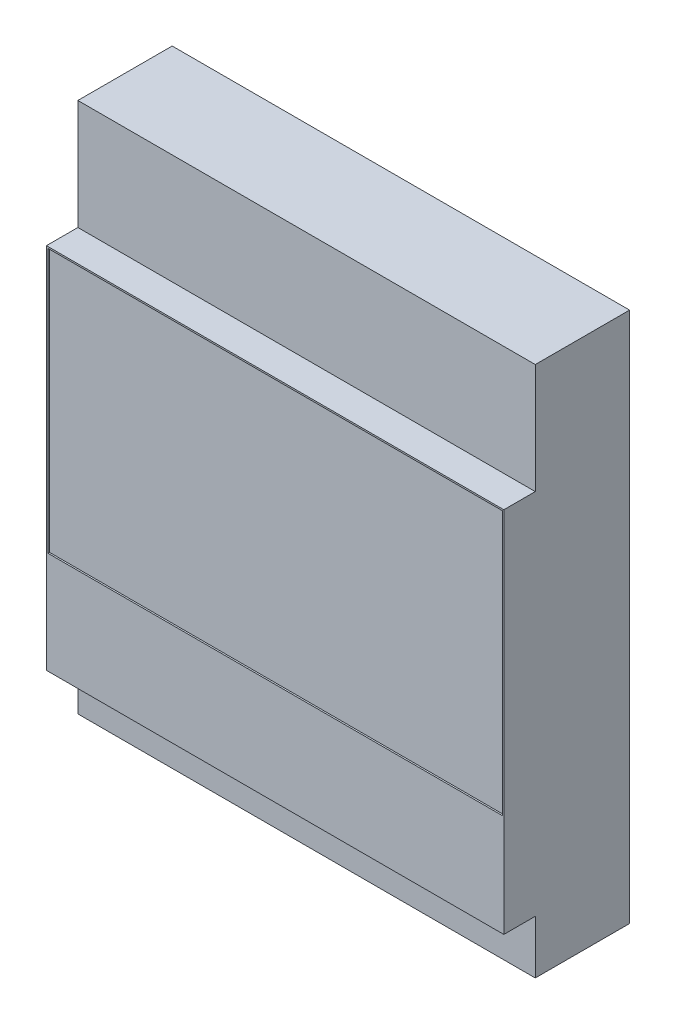
ISO-10303-21;
HEADER;
FILE_DESCRIPTION(('STEP AP214'),'2;1');
FILE_NAME('part.step','',(''),(''),'','','');
FILE_SCHEMA(('AUTOMOTIVE_DESIGN { 1 0 10303 214 1 1 1 1 }'));
ENDSEC;
DATA;
#1=APPLICATION_CONTEXT('core data for automotive mechanical design processes');
#2=APPLICATION_PROTOCOL_DEFINITION('international standard','automotive_design',2000,#1);
#3=PRODUCT_CONTEXT('',#1,'mechanical');
#4=PRODUCT('Part','Part','',(#3));
#5=PRODUCT_RELATED_PRODUCT_CATEGORY('part','',(#4));
#6=PRODUCT_DEFINITION_FORMATION('','',#4);
#7=PRODUCT_DEFINITION_CONTEXT('part definition',#1,'design');
#8=PRODUCT_DEFINITION('design','',#6,#7);
#9=PRODUCT_DEFINITION_SHAPE('','',#8);
#10=(LENGTH_UNIT() NAMED_UNIT(*) SI_UNIT(.MILLI.,.METRE.));
#11=(NAMED_UNIT(*) PLANE_ANGLE_UNIT() SI_UNIT($,.RADIAN.));
#12=(NAMED_UNIT(*) SI_UNIT($,.STERADIAN.) SOLID_ANGLE_UNIT());
#13=UNCERTAINTY_MEASURE_WITH_UNIT(LENGTH_MEASURE(1.E-05),#10,'distance_accuracy_value','');
#14=(GEOMETRIC_REPRESENTATION_CONTEXT(3) GLOBAL_UNCERTAINTY_ASSIGNED_CONTEXT((#13)) GLOBAL_UNIT_ASSIGNED_CONTEXT((#10,
#11,#12)) REPRESENTATION_CONTEXT('',''));
#15=CARTESIAN_POINT('',(0.,0.,0.));
#16=DIRECTION('',(0.,0.,1.));
#17=DIRECTION('',(1.,0.,0.));
#18=AXIS2_PLACEMENT_3D('',#15,#16,#17);
#19=CARTESIAN_POINT('',(7.275,-5.85,1.));
#20=DIRECTION('',(-1.,0.,0.));
#21=DIRECTION('',(0.,0.,1.));
#22=AXIS2_PLACEMENT_3D('',#19,#20,#21);
#23=PLANE('',#22);
#24=DIRECTION('',(0.,0.,-1.));
#25=VECTOR('',#24,1.);
#26=CARTESIAN_POINT('',(7.275,-5.85,1.));
#27=LINE('',#26,#25);
#28=CARTESIAN_POINT('',(7.275,-5.85,1.));
#29=VERTEX_POINT('',#28);
#30=CARTESIAN_POINT('',(7.275,-5.85,0.));
#31=VERTEX_POINT('',#30);
#32=EDGE_CURVE('E118',#29,#31,#27,.T.);
#33=ORIENTED_EDGE('',*,*,#32,.T.);
#34=DIRECTION('',(0.,-1.,0.));
#35=VECTOR('',#34,1.);
#36=CARTESIAN_POINT('',(7.275,9.35,0.));
#37=LINE('',#36,#35);
#38=CARTESIAN_POINT('',(7.275,-7.55,0.));
#39=VERTEX_POINT('',#38);
#40=EDGE_CURVE('E204',#31,#39,#37,.T.);
#41=ORIENTED_EDGE('',*,*,#40,.T.);
#42=DIRECTION('',(0.,0.,1.));
#43=VECTOR('',#42,1.);
#44=CARTESIAN_POINT('',(7.275,-7.55,-3.));
#45=LINE('',#44,#43);
#46=CARTESIAN_POINT('',(7.275,-7.55,-3.));
#47=VERTEX_POINT('',#46);
#48=EDGE_CURVE('E174',#47,#39,#45,.T.);
#49=ORIENTED_EDGE('',*,*,#48,.F.);
#50=DIRECTION('',(0.,-1.,0.));
#51=VECTOR('',#50,1.);
#52=CARTESIAN_POINT('',(7.275,9.35,-3.));
#53=LINE('',#52,#51);
#54=CARTESIAN_POINT('',(7.275,9.35,-3.));
#55=VERTEX_POINT('',#54);
#56=EDGE_CURVE('E242',#55,#47,#53,.T.);
#57=ORIENTED_EDGE('',*,*,#56,.F.);
#58=DIRECTION('',(0.,0.,1.));
#59=VECTOR('',#58,1.);
#60=CARTESIAN_POINT('',(7.275,9.35,-3.));
#61=LINE('',#60,#59);
#62=CARTESIAN_POINT('',(7.275,9.35,0.));
#63=VERTEX_POINT('',#62);
#64=EDGE_CURVE('E256',#55,#63,#61,.T.);
#65=ORIENTED_EDGE('',*,*,#64,.T.);
#66=CARTESIAN_POINT('',(7.275,5.85,0.));
#67=VERTEX_POINT('',#66);
#68=EDGE_CURVE('E209',#63,#67,#37,.T.);
#69=ORIENTED_EDGE('',*,*,#68,.T.);
#70=DIRECTION('',(0.,0.,-1.));
#71=VECTOR('',#70,1.);
#72=CARTESIAN_POINT('',(7.275,5.85,1.));
#73=LINE('',#72,#71);
#74=CARTESIAN_POINT('',(7.275,5.85,1.));
#75=VERTEX_POINT('',#74);
#76=EDGE_CURVE('E11',#75,#67,#73,.T.);
#77=ORIENTED_EDGE('',*,*,#76,.F.);
#78=DIRECTION('',(0.,1.,0.));
#79=VECTOR('',#78,1.);
#80=CARTESIAN_POINT('',(7.275,-5.85,1.));
#81=LINE('',#80,#79);
#82=EDGE_CURVE('E105',#29,#75,#81,.T.);
#83=ORIENTED_EDGE('',*,*,#82,.F.);
#84=EDGE_LOOP('',(#33,#41,#49,#57,#65,#69,#77,#83));
#85=FACE_BOUND('',#84,.T.);
#86=ADVANCED_FACE('F35',(#85),#23,.F.);
#87=CARTESIAN_POINT('',(-7.275,5.85,1.));
#88=DIRECTION('',(0.,-1.,0.));
#89=DIRECTION('',(0.,0.,-1.));
#90=AXIS2_PLACEMENT_3D('',#87,#88,#89);
#91=PLANE('',#90);
#92=DIRECTION('',(-1.,0.,0.));
#93=VECTOR('',#92,1.);
#94=CARTESIAN_POINT('',(-7.275,5.85,0.));
#95=LINE('',#94,#93);
#96=CARTESIAN_POINT('',(-7.275,5.85,0.));
#97=VERTEX_POINT('',#96);
#98=EDGE_CURVE('E111',#67,#97,#95,.T.);
#99=ORIENTED_EDGE('',*,*,#98,.T.);
#100=DIRECTION('',(0.,0.,-1.));
#101=VECTOR('',#100,1.);
#102=CARTESIAN_POINT('',(-7.275,5.85,1.));
#103=LINE('',#102,#101);
#104=CARTESIAN_POINT('',(-7.275,5.85,1.));
#105=VERTEX_POINT('',#104);
#106=EDGE_CURVE('E42',#105,#97,#103,.T.);
#107=ORIENTED_EDGE('',*,*,#106,.F.);
#108=DIRECTION('',(-1.,0.,0.));
#109=VECTOR('',#108,1.);
#110=CARTESIAN_POINT('',(-7.275,5.85,1.));
#111=LINE('',#110,#109);
#112=EDGE_CURVE('E98',#75,#105,#111,.T.);
#113=ORIENTED_EDGE('',*,*,#112,.F.);
#114=ORIENTED_EDGE('',*,*,#76,.T.);
#115=EDGE_LOOP('',(#99,#107,#113,#114));
#116=FACE_BOUND('',#115,.T.);
#117=ADVANCED_FACE('F110',(#116),#91,.F.);
#118=CARTESIAN_POINT('',(-7.275,-5.85,1.));
#119=DIRECTION('',(1.,0.,0.));
#120=DIRECTION('',(0.,0.,-1.));
#121=AXIS2_PLACEMENT_3D('',#118,#119,#120);
#122=PLANE('',#121);
#123=ORIENTED_EDGE('',*,*,#106,.T.);
#124=DIRECTION('',(0.,1.,0.));
#125=VECTOR('',#124,1.);
#126=CARTESIAN_POINT('',(-7.275,9.35,0.));
#127=LINE('',#126,#125);
#128=CARTESIAN_POINT('',(-7.275,9.35,0.));
#129=VERTEX_POINT('',#128);
#130=EDGE_CURVE('E71',#97,#129,#127,.T.);
#131=ORIENTED_EDGE('',*,*,#130,.T.);
#132=DIRECTION('',(0.,0.,1.));
#133=VECTOR('',#132,1.);
#134=CARTESIAN_POINT('',(-7.275,9.35,-3.));
#135=LINE('',#134,#133);
#136=CARTESIAN_POINT('',(-7.275,9.35,-3.));
#137=VERTEX_POINT('',#136);
#138=EDGE_CURVE('E251',#137,#129,#135,.T.);
#139=ORIENTED_EDGE('',*,*,#138,.F.);
#140=DIRECTION('',(0.,1.,0.));
#141=VECTOR('',#140,1.);
#142=CARTESIAN_POINT('',(-7.275,9.35,-3.));
#143=LINE('',#142,#141);
#144=CARTESIAN_POINT('',(-7.275,-7.55,-3.));
#145=VERTEX_POINT('',#144);
#146=EDGE_CURVE('E241',#145,#137,#143,.T.);
#147=ORIENTED_EDGE('',*,*,#146,.F.);
#148=DIRECTION('',(0.,0.,1.));
#149=VECTOR('',#148,1.);
#150=CARTESIAN_POINT('',(-7.275,-7.55,-3.));
#151=LINE('',#150,#149);
#152=CARTESIAN_POINT('',(-7.275,-7.55,0.));
#153=VERTEX_POINT('',#152);
#154=EDGE_CURVE('E238',#145,#153,#151,.T.);
#155=ORIENTED_EDGE('',*,*,#154,.T.);
#156=CARTESIAN_POINT('',(-7.275,-5.85,0.));
#157=VERTEX_POINT('',#156);
#158=EDGE_CURVE('E259',#153,#157,#127,.T.);
#159=ORIENTED_EDGE('',*,*,#158,.T.);
#160=DIRECTION('',(0.,0.,-1.));
#161=VECTOR('',#160,1.);
#162=CARTESIAN_POINT('',(-7.275,-5.85,1.));
#163=LINE('',#162,#161);
#164=CARTESIAN_POINT('',(-7.275,-5.85,1.));
#165=VERTEX_POINT('',#164);
#166=EDGE_CURVE('E113',#165,#157,#163,.T.);
#167=ORIENTED_EDGE('',*,*,#166,.F.);
#168=DIRECTION('',(0.,-1.,0.));
#169=VECTOR('',#168,1.);
#170=CARTESIAN_POINT('',(-7.275,-5.85,1.));
#171=LINE('',#170,#169);
#172=EDGE_CURVE('E102',#105,#165,#171,.T.);
#173=ORIENTED_EDGE('',*,*,#172,.F.);
#174=EDGE_LOOP('',(#123,#131,#139,#147,#155,#159,#167,#173));
#175=FACE_BOUND('',#174,.T.);
#176=ADVANCED_FACE('F114',(#175),#122,.F.);
#177=CARTESIAN_POINT('',(-7.275,-5.85,1.));
#178=DIRECTION('',(0.,1.,0.));
#179=DIRECTION('',(0.,0.,1.));
#180=AXIS2_PLACEMENT_3D('',#177,#178,#179);
#181=PLANE('',#180);
#182=DIRECTION('',(1.,0.,0.));
#183=VECTOR('',#182,1.);
#184=CARTESIAN_POINT('',(-7.275,-5.85,0.));
#185=LINE('',#184,#183);
#186=EDGE_CURVE('E123',#157,#31,#185,.T.);
#187=ORIENTED_EDGE('',*,*,#186,.T.);
#188=ORIENTED_EDGE('',*,*,#32,.F.);
#189=DIRECTION('',(1.,0.,0.));
#190=VECTOR('',#189,1.);
#191=CARTESIAN_POINT('',(-7.275,-5.85,1.));
#192=LINE('',#191,#190);
#193=EDGE_CURVE('E58',#165,#29,#192,.T.);
#194=ORIENTED_EDGE('',*,*,#193,.F.);
#195=ORIENTED_EDGE('',*,*,#166,.T.);
#196=EDGE_LOOP('',(#187,#188,#194,#195));
#197=FACE_BOUND('',#196,.T.);
#198=ADVANCED_FACE('F129',(#197),#181,.F.);
#199=CARTESIAN_POINT('',(0.,0.,1.));
#200=DIRECTION('',(0.,0.,-1.));
#201=DIRECTION('',(-1.,0.,0.));
#202=AXIS2_PLACEMENT_3D('',#199,#200,#201);
#203=PLANE('',#202);
#204=DIRECTION('',(1.,0.,0.));
#205=VECTOR('',#204,1.);
#206=CARTESIAN_POINT('',(-7.225,-2.6,1.));
#207=LINE('',#206,#205);
#208=CARTESIAN_POINT('',(-7.225,-2.6,1.));
#209=VERTEX_POINT('',#208);
#210=CARTESIAN_POINT('',(7.225,-2.6,1.));
#211=VERTEX_POINT('',#210);
#212=EDGE_CURVE('E151',#209,#211,#207,.T.);
#213=ORIENTED_EDGE('',*,*,#212,.F.);
#214=DIRECTION('',(0.,-1.,0.));
#215=VECTOR('',#214,1.);
#216=CARTESIAN_POINT('',(-7.225,5.8,1.));
#217=LINE('',#216,#215);
#218=CARTESIAN_POINT('',(-7.225,5.8,1.));
#219=VERTEX_POINT('',#218);
#220=EDGE_CURVE('E49',#219,#209,#217,.T.);
#221=ORIENTED_EDGE('',*,*,#220,.F.);
#222=DIRECTION('',(-1.,0.,0.));
#223=VECTOR('',#222,1.);
#224=CARTESIAN_POINT('',(-7.225,5.8,1.));
#225=LINE('',#224,#223);
#226=CARTESIAN_POINT('',(7.225,5.8,1.));
#227=VERTEX_POINT('',#226);
#228=EDGE_CURVE('E168',#227,#219,#225,.T.);
#229=ORIENTED_EDGE('',*,*,#228,.F.);
#230=DIRECTION('',(0.,1.,0.));
#231=VECTOR('',#230,1.);
#232=CARTESIAN_POINT('',(7.225,5.8,1.));
#233=LINE('',#232,#231);
#234=EDGE_CURVE('E176',#211,#227,#233,.T.);
#235=ORIENTED_EDGE('',*,*,#234,.F.);
#236=EDGE_LOOP('',(#213,#221,#229,#235));
#237=FACE_BOUND('',#236,.T.);
#238=ORIENTED_EDGE('',*,*,#82,.T.);
#239=ORIENTED_EDGE('',*,*,#112,.T.);
#240=ORIENTED_EDGE('',*,*,#172,.T.);
#241=ORIENTED_EDGE('',*,*,#193,.T.);
#242=EDGE_LOOP('',(#238,#239,#240,#241));
#243=FACE_BOUND('',#242,.T.);
#244=ADVANCED_FACE('F100',(#237,#243),#203,.F.);
#245=CARTESIAN_POINT('',(-7.225,5.8,0.95));
#246=DIRECTION('',(-1.,0.,0.));
#247=DIRECTION('',(0.,-1.,0.));
#248=AXIS2_PLACEMENT_3D('',#245,#246,#247);
#249=PLANE('',#248);
#250=ORIENTED_EDGE('',*,*,#220,.T.);
#251=DIRECTION('',(0.,0.,1.));
#252=VECTOR('',#251,1.);
#253=CARTESIAN_POINT('',(-7.225,-2.6,0.95));
#254=LINE('',#253,#252);
#255=CARTESIAN_POINT('',(-7.225,-2.6,0.95));
#256=VERTEX_POINT('',#255);
#257=EDGE_CURVE('E156',#256,#209,#254,.T.);
#258=ORIENTED_EDGE('',*,*,#257,.F.);
#259=DIRECTION('',(0.,-1.,0.));
#260=VECTOR('',#259,1.);
#261=CARTESIAN_POINT('',(-7.225,5.8,0.95));
#262=LINE('',#261,#260);
#263=CARTESIAN_POINT('',(-7.225,5.8,0.95));
#264=VERTEX_POINT('',#263);
#265=EDGE_CURVE('E166',#264,#256,#262,.T.);
#266=ORIENTED_EDGE('',*,*,#265,.F.);
#267=DIRECTION('',(0.,0.,1.));
#268=VECTOR('',#267,1.);
#269=CARTESIAN_POINT('',(-7.225,5.8,0.95));
#270=LINE('',#269,#268);
#271=EDGE_CURVE('E81',#264,#219,#270,.T.);
#272=ORIENTED_EDGE('',*,*,#271,.T.);
#273=EDGE_LOOP('',(#250,#258,#266,#272));
#274=FACE_BOUND('',#273,.T.);
#275=ADVANCED_FACE('F185',(#274),#249,.F.);
#276=CARTESIAN_POINT('',(-7.225,5.8,0.95));
#277=DIRECTION('',(0.,1.,0.));
#278=DIRECTION('',(0.,0.,1.));
#279=AXIS2_PLACEMENT_3D('',#276,#277,#278);
#280=PLANE('',#279);
#281=ORIENTED_EDGE('',*,*,#228,.T.);
#282=ORIENTED_EDGE('',*,*,#271,.F.);
#283=DIRECTION('',(-1.,0.,0.));
#284=VECTOR('',#283,1.);
#285=CARTESIAN_POINT('',(-7.225,5.8,0.95));
#286=LINE('',#285,#284);
#287=CARTESIAN_POINT('',(7.225,5.8,0.95));
#288=VERTEX_POINT('',#287);
#289=EDGE_CURVE('E163',#288,#264,#286,.T.);
#290=ORIENTED_EDGE('',*,*,#289,.F.);
#291=DIRECTION('',(0.,0.,1.));
#292=VECTOR('',#291,1.);
#293=CARTESIAN_POINT('',(7.225,5.8,0.95));
#294=LINE('',#293,#292);
#295=EDGE_CURVE('E155',#288,#227,#294,.T.);
#296=ORIENTED_EDGE('',*,*,#295,.T.);
#297=EDGE_LOOP('',(#281,#282,#290,#296));
#298=FACE_BOUND('',#297,.T.);
#299=ADVANCED_FACE('F183',(#298),#280,.F.);
#300=CARTESIAN_POINT('',(7.225,5.8,0.95));
#301=DIRECTION('',(1.,0.,0.));
#302=DIRECTION('',(0.,1.,0.));
#303=AXIS2_PLACEMENT_3D('',#300,#301,#302);
#304=PLANE('',#303);
#305=ORIENTED_EDGE('',*,*,#234,.T.);
#306=ORIENTED_EDGE('',*,*,#295,.F.);
#307=DIRECTION('',(0.,1.,0.));
#308=VECTOR('',#307,1.);
#309=CARTESIAN_POINT('',(7.225,5.8,0.95));
#310=LINE('',#309,#308);
#311=CARTESIAN_POINT('',(7.225,-2.6,0.95));
#312=VERTEX_POINT('',#311);
#313=EDGE_CURVE('E159',#312,#288,#310,.T.);
#314=ORIENTED_EDGE('',*,*,#313,.F.);
#315=DIRECTION('',(0.,0.,1.));
#316=VECTOR('',#315,1.);
#317=CARTESIAN_POINT('',(7.225,-2.6,0.95));
#318=LINE('',#317,#316);
#319=EDGE_CURVE('E144',#312,#211,#318,.T.);
#320=ORIENTED_EDGE('',*,*,#319,.T.);
#321=EDGE_LOOP('',(#305,#306,#314,#320));
#322=FACE_BOUND('',#321,.T.);
#323=ADVANCED_FACE('F160',(#322),#304,.F.);
#324=CARTESIAN_POINT('',(-7.225,-2.6,0.95));
#325=DIRECTION('',(0.,-1.,0.));
#326=DIRECTION('',(0.,0.,-1.));
#327=AXIS2_PLACEMENT_3D('',#324,#325,#326);
#328=PLANE('',#327);
#329=ORIENTED_EDGE('',*,*,#212,.T.);
#330=ORIENTED_EDGE('',*,*,#319,.F.);
#331=DIRECTION('',(1.,0.,0.));
#332=VECTOR('',#331,1.);
#333=CARTESIAN_POINT('',(-7.225,-2.6,0.95));
#334=LINE('',#333,#332);
#335=EDGE_CURVE('E148',#256,#312,#334,.T.);
#336=ORIENTED_EDGE('',*,*,#335,.F.);
#337=ORIENTED_EDGE('',*,*,#257,.T.);
#338=EDGE_LOOP('',(#329,#330,#336,#337));
#339=FACE_BOUND('',#338,.T.);
#340=ADVANCED_FACE('F146',(#339),#328,.F.);
#341=CARTESIAN_POINT('',(0.,0.,0.95));
#342=DIRECTION('',(0.,0.,1.));
#343=DIRECTION('',(1.,0.,0.));
#344=AXIS2_PLACEMENT_3D('',#341,#342,#343);
#345=PLANE('',#344);
#346=ORIENTED_EDGE('',*,*,#265,.T.);
#347=ORIENTED_EDGE('',*,*,#335,.T.);
#348=ORIENTED_EDGE('',*,*,#313,.T.);
#349=ORIENTED_EDGE('',*,*,#289,.T.);
#350=EDGE_LOOP('',(#346,#347,#348,#349));
#351=FACE_BOUND('',#350,.T.);
#352=ADVANCED_FACE('F165',(#351),#345,.T.);
#353=CARTESIAN_POINT('',(0.,0.,0.));
#354=DIRECTION('',(0.,0.,-1.));
#355=DIRECTION('',(-1.,0.,0.));
#356=AXIS2_PLACEMENT_3D('',#353,#354,#355);
#357=PLANE('',#356);
#358=ORIENTED_EDGE('',*,*,#186,.F.);
#359=ORIENTED_EDGE('',*,*,#158,.F.);
#360=DIRECTION('',(-1.,0.,0.));
#361=VECTOR('',#360,1.);
#362=CARTESIAN_POINT('',(7.275,-7.55,0.));
#363=LINE('',#362,#361);
#364=EDGE_CURVE('E261',#39,#153,#363,.T.);
#365=ORIENTED_EDGE('',*,*,#364,.F.);
#366=ORIENTED_EDGE('',*,*,#40,.F.);
#367=EDGE_LOOP('',(#358,#359,#365,#366));
#368=FACE_BOUND('',#367,.T.);
#369=ADVANCED_FACE('F271',(#368),#357,.F.);
#370=CARTESIAN_POINT('',(7.275,-7.55,-3.));
#371=DIRECTION('',(0.,1.,0.));
#372=DIRECTION('',(-1.,0.,0.));
#373=AXIS2_PLACEMENT_3D('',#370,#371,#372);
#374=PLANE('',#373);
#375=ORIENTED_EDGE('',*,*,#364,.T.);
#376=ORIENTED_EDGE('',*,*,#154,.F.);
#377=DIRECTION('',(-1.,0.,0.));
#378=VECTOR('',#377,1.);
#379=CARTESIAN_POINT('',(7.275,-7.55,-3.));
#380=LINE('',#379,#378);
#381=EDGE_CURVE('E234',#47,#145,#380,.T.);
#382=ORIENTED_EDGE('',*,*,#381,.F.);
#383=ORIENTED_EDGE('',*,*,#48,.T.);
#384=EDGE_LOOP('',(#375,#376,#382,#383));
#385=FACE_BOUND('',#384,.T.);
#386=ADVANCED_FACE('F236',(#385),#374,.F.);
#387=CARTESIAN_POINT('',(7.275,9.35,-3.));
#388=DIRECTION('',(0.,-1.,0.));
#389=DIRECTION('',(1.,0.,0.));
#390=AXIS2_PLACEMENT_3D('',#387,#388,#389);
#391=PLANE('',#390);
#392=DIRECTION('',(1.,0.,0.));
#393=VECTOR('',#392,1.);
#394=CARTESIAN_POINT('',(7.275,9.35,0.));
#395=LINE('',#394,#393);
#396=EDGE_CURVE('E249',#129,#63,#395,.T.);
#397=ORIENTED_EDGE('',*,*,#396,.T.);
#398=ORIENTED_EDGE('',*,*,#64,.F.);
#399=DIRECTION('',(1.,0.,0.));
#400=VECTOR('',#399,1.);
#401=CARTESIAN_POINT('',(7.275,9.35,-3.));
#402=LINE('',#401,#400);
#403=EDGE_CURVE('E247',#137,#55,#402,.T.);
#404=ORIENTED_EDGE('',*,*,#403,.F.);
#405=ORIENTED_EDGE('',*,*,#138,.T.);
#406=EDGE_LOOP('',(#397,#398,#404,#405));
#407=FACE_BOUND('',#406,.T.);
#408=ADVANCED_FACE('F267',(#407),#391,.F.);
#409=CARTESIAN_POINT('',(0.,0.,-3.));
#410=DIRECTION('',(0.,0.,-1.));
#411=DIRECTION('',(-1.,0.,0.));
#412=AXIS2_PLACEMENT_3D('',#409,#410,#411);
#413=PLANE('',#412);
#414=ORIENTED_EDGE('',*,*,#56,.T.);
#415=ORIENTED_EDGE('',*,*,#381,.T.);
#416=ORIENTED_EDGE('',*,*,#146,.T.);
#417=ORIENTED_EDGE('',*,*,#403,.T.);
#418=EDGE_LOOP('',(#414,#415,#416,#417));
#419=FACE_BOUND('',#418,.T.);
#420=ADVANCED_FACE('F245',(#419),#413,.T.);
#421=ORIENTED_EDGE('',*,*,#98,.F.);
#422=ORIENTED_EDGE('',*,*,#68,.F.);
#423=ORIENTED_EDGE('',*,*,#396,.F.);
#424=ORIENTED_EDGE('',*,*,#130,.F.);
#425=EDGE_LOOP('',(#421,#422,#423,#424));
#426=FACE_BOUND('',#425,.T.);
#427=ADVANCED_FACE('F268',(#426),#357,.F.);
#428=CLOSED_SHELL('',(#86,#117,#176,#198,#244,#275,#299,#323,#340,#352,#369,#386,#408,#420,#427));
#429=MANIFOLD_SOLID_BREP('B2',#428);
#430=ADVANCED_BREP_SHAPE_REPRESENTATION('',(#18,#429),#14);
#431=SHAPE_DEFINITION_REPRESENTATION(#9,#430);
ENDSEC;
END-ISO-10303-21;
